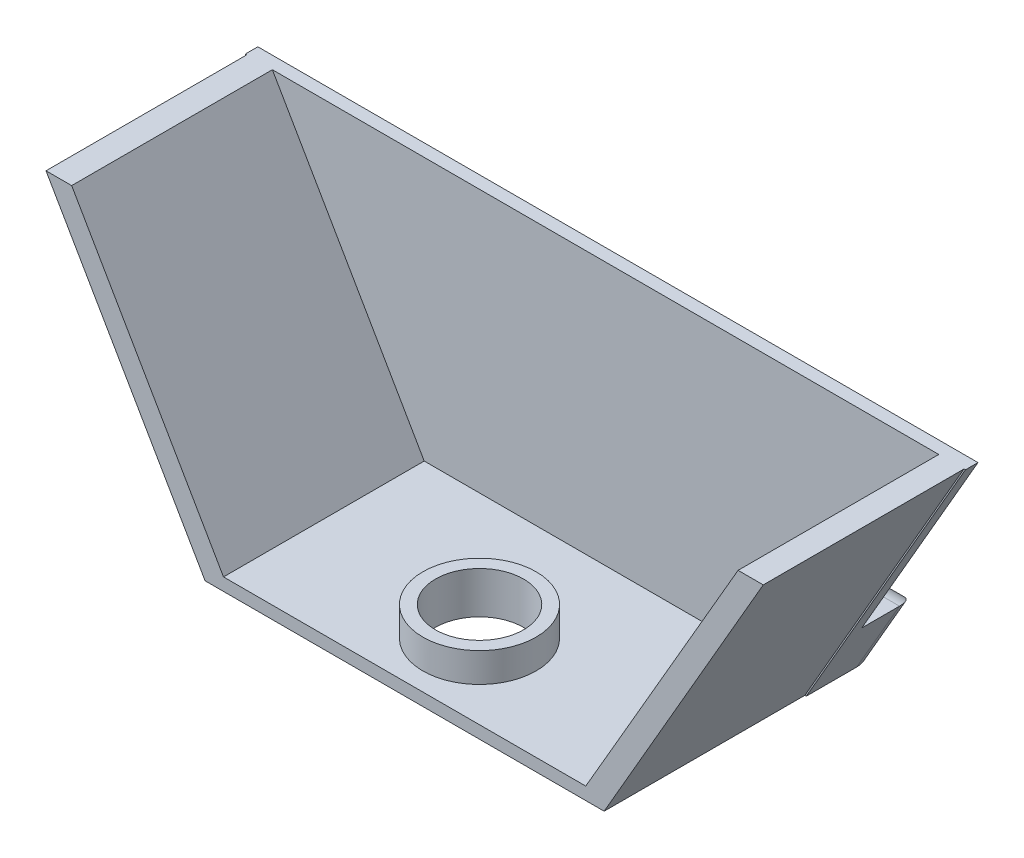
ISO-10303-21;
HEADER;
FILE_DESCRIPTION(('STEP AP214'),'2;1');
FILE_NAME('part.step','',(''),(''),'','','');
FILE_SCHEMA(('AUTOMOTIVE_DESIGN { 1 0 10303 214 1 1 1 1 }'));
ENDSEC;
DATA;
#1=APPLICATION_CONTEXT('core data for automotive mechanical design processes');
#2=APPLICATION_PROTOCOL_DEFINITION('international standard','automotive_design',2000,#1);
#3=PRODUCT_CONTEXT('',#1,'mechanical');
#4=PRODUCT('Part','Part','',(#3));
#5=PRODUCT_RELATED_PRODUCT_CATEGORY('part','',(#4));
#6=PRODUCT_DEFINITION_FORMATION('','',#4);
#7=PRODUCT_DEFINITION_CONTEXT('part definition',#1,'design');
#8=PRODUCT_DEFINITION('design','',#6,#7);
#9=PRODUCT_DEFINITION_SHAPE('','',#8);
#10=(LENGTH_UNIT() NAMED_UNIT(*) SI_UNIT(.MILLI.,.METRE.));
#11=(NAMED_UNIT(*) PLANE_ANGLE_UNIT() SI_UNIT($,.RADIAN.));
#12=(NAMED_UNIT(*) SI_UNIT($,.STERADIAN.) SOLID_ANGLE_UNIT());
#13=UNCERTAINTY_MEASURE_WITH_UNIT(LENGTH_MEASURE(1.E-05),#10,'distance_accuracy_value','');
#14=(GEOMETRIC_REPRESENTATION_CONTEXT(3) GLOBAL_UNCERTAINTY_ASSIGNED_CONTEXT((#13)) GLOBAL_UNIT_ASSIGNED_CONTEXT((#10,
#11,#12)) REPRESENTATION_CONTEXT('',''));
#15=CARTESIAN_POINT('',(0.,0.,0.));
#16=DIRECTION('',(0.,0.,1.));
#17=DIRECTION('',(1.,0.,0.));
#18=AXIS2_PLACEMENT_3D('',#15,#16,#17);
#19=CARTESIAN_POINT('',(0.,0.,1.));
#20=DIRECTION('',(0.,0.,1.));
#21=DIRECTION('',(1.,0.,0.));
#22=AXIS2_PLACEMENT_3D('',#19,#20,#21);
#23=PLANE('',#22);
#24=DIRECTION('',(0.499999999999997,0.86602540378444,0.));
#25=VECTOR('',#24,1.);
#26=CARTESIAN_POINT('',(73.9015839370712,1.50114399294237,1.));
#27=LINE('',#26,#25);
#28=CARTESIAN_POINT('',(73.9015839370712,1.50114399294237,1.));
#29=VERTEX_POINT('',#28);
#30=CARTESIAN_POINT('',(86.5455548323239,23.4011439929424,1.));
#31=VERTEX_POINT('',#30);
#32=EDGE_CURVE('E56',#29,#31,#27,.T.);
#33=ORIENTED_EDGE('',*,*,#32,.F.);
#34=DIRECTION('',(1.,0.,0.));
#35=VECTOR('',#34,1.);
#36=CARTESIAN_POINT('',(42.074789017828,1.50114399294237,1.));
#37=LINE('',#36,#35);
#38=CARTESIAN_POINT('',(74.017053990909,1.50114399294237,1.));
#39=VERTEX_POINT('',#38);
#40=EDGE_CURVE('E248',#29,#39,#37,.T.);
#41=ORIENTED_EDGE('',*,*,#40,.T.);
#42=DIRECTION('',(0.5,0.866025403784439,0.));
#43=VECTOR('',#42,1.);
#44=CARTESIAN_POINT('',(74.017053990909,1.50114399294237,1.));
#45=LINE('',#44,#43);
#46=CARTESIAN_POINT('',(86.6610248861619,23.4011439929424,1.));
#47=VERTEX_POINT('',#46);
#48=EDGE_CURVE('E238',#39,#47,#45,.T.);
#49=ORIENTED_EDGE('',*,*,#48,.T.);
#50=DIRECTION('',(-1.,0.,0.));
#51=VECTOR('',#50,1.);
#52=CARTESIAN_POINT('',(86.6610248861619,23.4011439929424,1.));
#53=LINE('',#52,#51);
#54=EDGE_CURVE('E243',#47,#31,#53,.T.);
#55=ORIENTED_EDGE('',*,*,#54,.T.);
#56=EDGE_LOOP('',(#33,#41,#49,#55));
#57=FACE_BOUND('',#56,.T.);
#58=ADVANCED_FACE('F33',(#57),#23,.T.);
#59=DIRECTION('',(0.500000000000008,-0.866025403784434,0.));
#60=VECTOR('',#59,1.);
#61=CARTESIAN_POINT('',(29.546288176413,23.4011439929424,1.));
#62=LINE('',#61,#60);
#63=CARTESIAN_POINT('',(29.546288176413,23.4011439929424,1.));
#64=VERTEX_POINT('',#63);
#65=CARTESIAN_POINT('',(42.1902590716661,1.50114399294237,1.));
#66=VERTEX_POINT('',#65);
#67=EDGE_CURVE('E387',#64,#66,#62,.T.);
#68=ORIENTED_EDGE('',*,*,#67,.F.);
#69=CARTESIAN_POINT('',(29.4308181225752,23.4011439929424,1.));
#70=VERTEX_POINT('',#69);
#71=EDGE_CURVE('E241',#64,#70,#53,.T.);
#72=ORIENTED_EDGE('',*,*,#71,.T.);
#73=DIRECTION('',(0.5,-0.866025403784439,0.));
#74=VECTOR('',#73,1.);
#75=CARTESIAN_POINT('',(29.4308181225752,23.4011439929424,1.));
#76=LINE('',#75,#74);
#77=CARTESIAN_POINT('',(42.074789017828,1.50114399294237,1.));
#78=VERTEX_POINT('',#77);
#79=EDGE_CURVE('E245',#70,#78,#76,.T.);
#80=ORIENTED_EDGE('',*,*,#79,.T.);
#81=EDGE_CURVE('E249',#78,#66,#37,.T.);
#82=ORIENTED_EDGE('',*,*,#81,.T.);
#83=EDGE_LOOP('',(#68,#72,#80,#82));
#84=FACE_BOUND('',#83,.T.);
#85=ADVANCED_FACE('F384',(#84),#23,.T.);
#86=CARTESIAN_POINT('',(0.,0.,0.));
#87=DIRECTION('',(0.,0.,1.));
#88=DIRECTION('',(1.,0.,0.));
#89=AXIS2_PLACEMENT_3D('',#86,#87,#88);
#90=PLANE('',#89);
#91=DIRECTION('',(1.,0.,0.));
#92=VECTOR('',#91,1.);
#93=CARTESIAN_POINT('',(44.974789017828,7.40114399294237,0.));
#94=LINE('',#93,#92);
#95=CARTESIAN_POINT('',(38.6684224296092,7.40114399294237,0.));
#96=VERTEX_POINT('',#95);
#97=CARTESIAN_POINT('',(44.974789017828,7.40114399294237,0.));
#98=VERTEX_POINT('',#97);
#99=EDGE_CURVE('E212',#96,#98,#94,.T.);
#100=ORIENTED_EDGE('',*,*,#99,.F.);
#101=DIRECTION('',(0.5,-0.866025403784439,0.));
#102=VECTOR('',#101,1.);
#103=CARTESIAN_POINT('',(29.4308181225752,23.4011439929424,0.));
#104=LINE('',#103,#102);
#105=CARTESIAN_POINT('',(29.4308181225752,23.4011439929424,0.));
#106=VERTEX_POINT('',#105);
#107=EDGE_CURVE('E255',#106,#96,#104,.T.);
#108=ORIENTED_EDGE('',*,*,#107,.F.);
#109=DIRECTION('',(-1.,0.,0.));
#110=VECTOR('',#109,1.);
#111=CARTESIAN_POINT('',(86.6610248861619,23.4011439929424,0.));
#112=LINE('',#111,#110);
#113=CARTESIAN_POINT('',(86.6610248861619,23.4011439929424,0.));
#114=VERTEX_POINT('',#113);
#115=EDGE_CURVE('E253',#114,#106,#112,.T.);
#116=ORIENTED_EDGE('',*,*,#115,.F.);
#117=DIRECTION('',(0.5,0.866025403784439,0.));
#118=VECTOR('',#117,1.);
#119=CARTESIAN_POINT('',(74.017053990909,1.50114399294237,0.));
#120=LINE('',#119,#118);
#121=CARTESIAN_POINT('',(77.4234205791278,7.40114399294237,0.));
#122=VERTEX_POINT('',#121);
#123=EDGE_CURVE('E237',#122,#114,#120,.T.);
#124=ORIENTED_EDGE('',*,*,#123,.F.);
#125=DIRECTION('',(1.,0.,0.));
#126=VECTOR('',#125,1.);
#127=CARTESIAN_POINT('',(71.117053990909,7.40114399294237,0.));
#128=LINE('',#127,#126);
#129=CARTESIAN_POINT('',(71.117053990909,7.40114399294237,0.));
#130=VERTEX_POINT('',#129);
#131=EDGE_CURVE('E228',#130,#122,#128,.T.);
#132=ORIENTED_EDGE('',*,*,#131,.F.);
#133=DIRECTION('',(0.,1.,0.));
#134=VECTOR('',#133,1.);
#135=CARTESIAN_POINT('',(71.117053990909,1.50114399294237,0.));
#136=LINE('',#135,#134);
#137=CARTESIAN_POINT('',(71.117053990909,1.50114399294237,0.));
#138=VERTEX_POINT('',#137);
#139=EDGE_CURVE('E225',#138,#130,#136,.T.);
#140=ORIENTED_EDGE('',*,*,#139,.F.);
#141=DIRECTION('',(1.,0.,0.));
#142=VECTOR('',#141,1.);
#143=CARTESIAN_POINT('',(42.074789017828,1.50114399294237,0.));
#144=LINE('',#143,#142);
#145=CARTESIAN_POINT('',(44.974789017828,1.50114399294237,0.));
#146=VERTEX_POINT('',#145);
#147=EDGE_CURVE('E242',#146,#138,#144,.T.);
#148=ORIENTED_EDGE('',*,*,#147,.F.);
#149=DIRECTION('',(0.,-1.,0.));
#150=VECTOR('',#149,1.);
#151=CARTESIAN_POINT('',(44.974789017828,1.50114399294237,0.));
#152=LINE('',#151,#150);
#153=EDGE_CURVE('E215',#98,#146,#152,.T.);
#154=ORIENTED_EDGE('',*,*,#153,.F.);
#155=EDGE_LOOP('',(#100,#108,#116,#124,#132,#140,#148,#154));
#156=FACE_BOUND('',#155,.T.);
#157=ADVANCED_FACE('F345',(#156),#90,.F.);
#158=CARTESIAN_POINT('',(74.017053990909,1.50114399294237,1.));
#159=DIRECTION('',(-0.866025403784439,0.5,0.));
#160=DIRECTION('',(-0.5,-0.866025403784439,0.));
#161=AXIS2_PLACEMENT_3D('',#158,#159,#160);
#162=PLANE('',#161);
#163=DIRECTION('',(0.,0.,-1.));
#164=VECTOR('',#163,1.);
#165=CARTESIAN_POINT('',(74.017053990909,1.50114399294237,1.));
#166=LINE('',#165,#164);
#167=CARTESIAN_POINT('',(74.017053990909,1.50114399294237,-3.));
#168=VERTEX_POINT('',#167);
#169=EDGE_CURVE('E251',#39,#168,#166,.T.);
#170=ORIENTED_EDGE('',*,*,#169,.T.);
#171=DIRECTION('',(-0.5,-0.866025403784439,0.));
#172=VECTOR('',#171,1.);
#173=CARTESIAN_POINT('',(77.4234205791278,7.40114399294238,-3.));
#174=LINE('',#173,#172);
#175=CARTESIAN_POINT('',(77.4234205791278,7.40114399294237,-3.));
#176=VERTEX_POINT('',#175);
#177=EDGE_CURVE('E41',#168,#176,#174,.F.);
#178=ORIENTED_EDGE('',*,*,#177,.T.);
#179=DIRECTION('',(0.,0.,1.));
#180=VECTOR('',#179,1.);
#181=CARTESIAN_POINT('',(77.4234205791278,7.40114399294237,-5.));
#182=LINE('',#181,#180);
#183=EDGE_CURVE('E231',#176,#122,#182,.T.);
#184=ORIENTED_EDGE('',*,*,#183,.T.);
#185=ORIENTED_EDGE('',*,*,#123,.T.);
#186=DIRECTION('',(0.,0.,-1.));
#187=VECTOR('',#186,1.);
#188=CARTESIAN_POINT('',(86.6610248861619,23.4011439929424,1.));
#189=LINE('',#188,#187);
#190=EDGE_CURVE('E268',#47,#114,#189,.T.);
#191=ORIENTED_EDGE('',*,*,#190,.F.);
#192=ORIENTED_EDGE('',*,*,#48,.F.);
#193=EDGE_LOOP('',(#170,#178,#184,#185,#191,#192));
#194=FACE_BOUND('',#193,.T.);
#195=ADVANCED_FACE('F334',(#194),#162,.F.);
#196=CARTESIAN_POINT('',(86.6610248861619,23.4011439929424,1.));
#197=DIRECTION('',(0.,-1.,0.));
#198=DIRECTION('',(0.,0.,-1.));
#199=AXIS2_PLACEMENT_3D('',#196,#197,#198);
#200=PLANE('',#199);
#201=ORIENTED_EDGE('',*,*,#115,.T.);
#202=DIRECTION('',(0.,0.,-1.));
#203=VECTOR('',#202,1.);
#204=CARTESIAN_POINT('',(29.4308181225752,23.4011439929424,1.));
#205=LINE('',#204,#203);
#206=EDGE_CURVE('E265',#70,#106,#205,.T.);
#207=ORIENTED_EDGE('',*,*,#206,.F.);
#208=ORIENTED_EDGE('',*,*,#71,.F.);
#209=DIRECTION('',(0.,0.,-1.));
#210=VECTOR('',#209,1.);
#211=CARTESIAN_POINT('',(29.546288176413,23.4011439929424,16.95));
#212=LINE('',#211,#210);
#213=CARTESIAN_POINT('',(29.546288176413,23.4011439929424,16.95));
#214=VERTEX_POINT('',#213);
#215=EDGE_CURVE('E406',#214,#64,#212,.T.);
#216=ORIENTED_EDGE('',*,*,#215,.F.);
#217=DIRECTION('',(-1.,0.,0.));
#218=VECTOR('',#217,1.);
#219=CARTESIAN_POINT('',(29.546288176413,23.4011439929424,16.95));
#220=LINE('',#219,#218);
#221=CARTESIAN_POINT('',(31.5855186609545,23.4011439929424,16.95));
#222=VERTEX_POINT('',#221);
#223=EDGE_CURVE('E416',#222,#214,#220,.T.);
#224=ORIENTED_EDGE('',*,*,#223,.F.);
#225=DIRECTION('',(0.,0.,-1.));
#226=VECTOR('',#225,1.);
#227=CARTESIAN_POINT('',(31.5855186609545,23.4011439929424,16.95));
#228=LINE('',#227,#226);
#229=CARTESIAN_POINT('',(31.5855186609545,23.4011439929424,1.));
#230=VERTEX_POINT('',#229);
#231=EDGE_CURVE('E208',#222,#230,#228,.T.);
#232=ORIENTED_EDGE('',*,*,#231,.T.);
#233=CARTESIAN_POINT('',(84.5455548323239,23.4011439929424,1.));
#234=VERTEX_POINT('',#233);
#235=EDGE_CURVE('E246',#234,#230,#53,.T.);
#236=ORIENTED_EDGE('',*,*,#235,.F.);
#237=DIRECTION('',(0.,0.,-1.));
#238=VECTOR('',#237,1.);
#239=CARTESIAN_POINT('',(84.5455548323239,23.4011439929424,16.95));
#240=LINE('',#239,#238);
#241=CARTESIAN_POINT('',(84.5455548323239,23.4011439929424,16.95));
#242=VERTEX_POINT('',#241);
#243=EDGE_CURVE('E408',#242,#234,#240,.T.);
#244=ORIENTED_EDGE('',*,*,#243,.F.);
#245=DIRECTION('',(-1.,0.,0.));
#246=VECTOR('',#245,1.);
#247=CARTESIAN_POINT('',(86.5455548323239,23.4011439929424,16.95));
#248=LINE('',#247,#246);
#249=CARTESIAN_POINT('',(86.5455548323239,23.4011439929424,16.95));
#250=VERTEX_POINT('',#249);
#251=EDGE_CURVE('E197',#250,#242,#248,.T.);
#252=ORIENTED_EDGE('',*,*,#251,.F.);
#253=DIRECTION('',(0.,0.,-1.));
#254=VECTOR('',#253,1.);
#255=CARTESIAN_POINT('',(86.5455548323239,23.4011439929424,16.95));
#256=LINE('',#255,#254);
#257=EDGE_CURVE('E404',#250,#31,#256,.T.);
#258=ORIENTED_EDGE('',*,*,#257,.T.);
#259=ORIENTED_EDGE('',*,*,#54,.F.);
#260=ORIENTED_EDGE('',*,*,#190,.T.);
#261=EDGE_LOOP('',(#201,#207,#208,#216,#224,#232,#236,#244,#252,#258,#259,#260));
#262=FACE_BOUND('',#261,.T.);
#263=ADVANCED_FACE('F391',(#262),#200,.F.);
#264=CARTESIAN_POINT('',(29.4308181225752,23.4011439929424,1.));
#265=DIRECTION('',(0.866025403784439,0.5,0.));
#266=DIRECTION('',(-0.5,0.866025403784439,0.));
#267=AXIS2_PLACEMENT_3D('',#264,#265,#266);
#268=PLANE('',#267);
#269=DIRECTION('',(0.,0.,1.));
#270=VECTOR('',#269,1.);
#271=CARTESIAN_POINT('',(38.6684224296092,7.40114399294237,-5.));
#272=LINE('',#271,#270);
#273=CARTESIAN_POINT('',(38.6684224296092,7.40114399294237,-3.));
#274=VERTEX_POINT('',#273);
#275=EDGE_CURVE('E223',#274,#96,#272,.T.);
#276=ORIENTED_EDGE('',*,*,#275,.F.);
#277=DIRECTION('',(-0.5,0.866025403784439,0.));
#278=VECTOR('',#277,1.);
#279=CARTESIAN_POINT('',(29.4308181225752,23.4011439929424,-3.));
#280=LINE('',#279,#278);
#281=CARTESIAN_POINT('',(42.074789017828,1.50114399294237,-3.));
#282=VERTEX_POINT('',#281);
#283=EDGE_CURVE('E291',#274,#282,#280,.F.);
#284=ORIENTED_EDGE('',*,*,#283,.T.);
#285=DIRECTION('',(0.,0.,-1.));
#286=VECTOR('',#285,1.);
#287=CARTESIAN_POINT('',(42.074789017828,1.50114399294237,1.));
#288=LINE('',#287,#286);
#289=EDGE_CURVE('E262',#78,#282,#288,.T.);
#290=ORIENTED_EDGE('',*,*,#289,.F.);
#291=ORIENTED_EDGE('',*,*,#79,.F.);
#292=ORIENTED_EDGE('',*,*,#206,.T.);
#293=ORIENTED_EDGE('',*,*,#107,.T.);
#294=EDGE_LOOP('',(#276,#284,#290,#291,#292,#293));
#295=FACE_BOUND('',#294,.T.);
#296=ADVANCED_FACE('F366',(#295),#268,.F.);
#297=CARTESIAN_POINT('',(42.074789017828,1.50114399294237,1.));
#298=DIRECTION('',(0.,1.,0.));
#299=DIRECTION('',(0.,0.,1.));
#300=AXIS2_PLACEMENT_3D('',#297,#298,#299);
#301=PLANE('',#300);
#302=CARTESIAN_POINT('',(58.0459215043686,1.50114399294237,11.));
#303=DIRECTION('',(0.,1.,0.));
#304=DIRECTION('',(-1.,0.,0.));
#305=AXIS2_PLACEMENT_3D('',#302,#303,#304);
#306=CIRCLE('',#305,3.5);
#307=CARTESIAN_POINT('',(54.5459215043685,1.50114399294237,11.));
#308=VERTEX_POINT('',#307);
#309=EDGE_CURVE('E437',#308,#308,#306,.T.);
#310=ORIENTED_EDGE('',*,*,#309,.T.);
#311=EDGE_LOOP('',(#310));
#312=FACE_BOUND('',#311,.T.);
#313=CARTESIAN_POINT('',(44.3841900945865,1.50114399294237,-3.));
#314=DIRECTION('',(0.,1.,0.));
#315=DIRECTION('',(-1.,0.,0.));
#316=AXIS2_PLACEMENT_3D('',#313,#314,#315);
#317=ELLIPSE('',#316,2.3094010767585,2.);
#318=CARTESIAN_POINT('',(43.6288943339285,1.50114399294237,-4.8900122315607));
#319=VERTEX_POINT('',#318);
#320=EDGE_CURVE('E282',#282,#319,#317,.F.);
#321=ORIENTED_EDGE('',*,*,#320,.T.);
#322=CARTESIAN_POINT('',(42.974789017828,1.50114399294237,-3.));
#323=DIRECTION('',(0.,1.,0.));
#324=DIRECTION('',(0.,0.,1.));
#325=AXIS2_PLACEMENT_3D('',#322,#323,#324);
#326=CIRCLE('',#325,2.);
#327=CARTESIAN_POINT('',(44.974789017828,1.50114399294237,-3.));
#328=VERTEX_POINT('',#327);
#329=EDGE_CURVE('E284',#319,#328,#326,.F.);
#330=ORIENTED_EDGE('',*,*,#329,.T.);
#331=DIRECTION('',(0.,0.,1.));
#332=VECTOR('',#331,1.);
#333=CARTESIAN_POINT('',(44.974789017828,1.50114399294237,-5.));
#334=LINE('',#333,#332);
#335=EDGE_CURVE('E219',#328,#146,#334,.T.);
#336=ORIENTED_EDGE('',*,*,#335,.T.);
#337=ORIENTED_EDGE('',*,*,#147,.T.);
#338=DIRECTION('',(0.,0.,1.));
#339=VECTOR('',#338,1.);
#340=CARTESIAN_POINT('',(71.117053990909,1.50114399294237,-5.));
#341=LINE('',#340,#339);
#342=CARTESIAN_POINT('',(71.117053990909,1.50114399294237,-3.));
#343=VERTEX_POINT('',#342);
#344=EDGE_CURVE('E235',#343,#138,#341,.T.);
#345=ORIENTED_EDGE('',*,*,#344,.F.);
#346=CARTESIAN_POINT('',(73.1170539909091,1.50114399294237,-3.));
#347=DIRECTION('',(0.,1.,0.));
#348=DIRECTION('',(0.,0.,1.));
#349=AXIS2_PLACEMENT_3D('',#346,#347,#348);
#350=CIRCLE('',#349,2.);
#351=CARTESIAN_POINT('',(72.4629486748085,1.50114399294237,-4.8900122315607));
#352=VERTEX_POINT('',#351);
#353=EDGE_CURVE('E280',#343,#352,#350,.F.);
#354=ORIENTED_EDGE('',*,*,#353,.T.);
#355=CARTESIAN_POINT('',(71.7076529141506,1.50114399294237,-3.));
#356=DIRECTION('',(0.,1.,0.));
#357=DIRECTION('',(1.,0.,0.));
#358=AXIS2_PLACEMENT_3D('',#355,#356,#357);
#359=ELLIPSE('',#358,2.3094010767585,2.);
#360=EDGE_CURVE('E278',#352,#168,#359,.F.);
#361=ORIENTED_EDGE('',*,*,#360,.T.);
#362=ORIENTED_EDGE('',*,*,#169,.F.);
#363=ORIENTED_EDGE('',*,*,#40,.F.);
#364=DIRECTION('',(0.,0.,-1.));
#365=VECTOR('',#364,1.);
#366=CARTESIAN_POINT('',(73.9015839370712,1.50114399294237,16.95));
#367=LINE('',#366,#365);
#368=CARTESIAN_POINT('',(73.9015839370712,1.50114399294237,16.95));
#369=VERTEX_POINT('',#368);
#370=EDGE_CURVE('E397',#369,#29,#367,.T.);
#371=ORIENTED_EDGE('',*,*,#370,.F.);
#372=DIRECTION('',(1.,0.,0.));
#373=VECTOR('',#372,1.);
#374=CARTESIAN_POINT('',(42.1902590716661,1.50114399294237,16.95));
#375=LINE('',#374,#373);
#376=CARTESIAN_POINT('',(42.1902590716661,1.50114399294237,16.95));
#377=VERTEX_POINT('',#376);
#378=EDGE_CURVE('E427',#377,#369,#375,.T.);
#379=ORIENTED_EDGE('',*,*,#378,.F.);
#380=DIRECTION('',(0.,0.,-1.));
#381=VECTOR('',#380,1.);
#382=CARTESIAN_POINT('',(42.1902590716661,1.50114399294237,16.95));
#383=LINE('',#382,#381);
#384=EDGE_CURVE('E403',#377,#66,#383,.T.);
#385=ORIENTED_EDGE('',*,*,#384,.T.);
#386=ORIENTED_EDGE('',*,*,#81,.F.);
#387=ORIENTED_EDGE('',*,*,#289,.T.);
#388=EDGE_LOOP('',(#321,#330,#336,#337,#345,#354,#361,#362,#363,#371,#379,#385,#386,#387));
#389=FACE_BOUND('',#388,.T.);
#390=ADVANCED_FACE('F352',(#312,#389),#301,.F.);
#391=DIRECTION('',(-0.501217698069667,-0.865321223096801,0.));
#392=VECTOR('',#391,1.);
#393=CARTESIAN_POINT('',(72.4397037217194,2.50114399294237,1.));
#394=LINE('',#393,#392);
#395=CARTESIAN_POINT('',(72.4397037217194,2.50114399294237,1.));
#396=VERTEX_POINT('',#395);
#397=EDGE_CURVE('E203',#234,#396,#394,.T.);
#398=ORIENTED_EDGE('',*,*,#397,.F.);
#399=ORIENTED_EDGE('',*,*,#235,.T.);
#400=DIRECTION('',(-0.5,0.866025403784438,0.));
#401=VECTOR('',#400,1.);
#402=CARTESIAN_POINT('',(43.6521392870177,2.50114399294237,1.));
#403=LINE('',#402,#401);
#404=CARTESIAN_POINT('',(43.6521392870177,2.50114399294237,1.));
#405=VERTEX_POINT('',#404);
#406=EDGE_CURVE('E420',#405,#230,#403,.T.);
#407=ORIENTED_EDGE('',*,*,#406,.F.);
#408=DIRECTION('',(-1.,0.,0.));
#409=VECTOR('',#408,1.);
#410=CARTESIAN_POINT('',(43.6521392870177,2.50114399294237,1.));
#411=LINE('',#410,#409);
#412=EDGE_CURVE('E48',#396,#405,#411,.T.);
#413=ORIENTED_EDGE('',*,*,#412,.F.);
#414=EDGE_LOOP('',(#398,#399,#407,#413));
#415=FACE_BOUND('',#414,.T.);
#416=ADVANCED_FACE('F458',(#415),#23,.T.);
#417=CARTESIAN_POINT('',(71.117053990909,1.50114399294237,-5.));
#418=DIRECTION('',(1.,0.,0.));
#419=DIRECTION('',(0.,0.,-1.));
#420=AXIS2_PLACEMENT_3D('',#417,#418,#419);
#421=PLANE('',#420);
#422=DIRECTION('',(0.,0.,1.));
#423=VECTOR('',#422,1.);
#424=CARTESIAN_POINT('',(71.117053990909,7.40114399294237,-5.));
#425=LINE('',#424,#423);
#426=CARTESIAN_POINT('',(71.117053990909,7.40114399294237,-3.));
#427=VERTEX_POINT('',#426);
#428=EDGE_CURVE('E233',#427,#130,#425,.T.);
#429=ORIENTED_EDGE('',*,*,#428,.F.);
#430=DIRECTION('',(0.,1.,0.));
#431=VECTOR('',#430,1.);
#432=CARTESIAN_POINT('',(71.117053990909,1.50114399294237,-3.));
#433=LINE('',#432,#431);
#434=EDGE_CURVE('E303',#427,#343,#433,.F.);
#435=ORIENTED_EDGE('',*,*,#434,.T.);
#436=ORIENTED_EDGE('',*,*,#344,.T.);
#437=ORIENTED_EDGE('',*,*,#139,.T.);
#438=EDGE_LOOP('',(#429,#435,#436,#437));
#439=FACE_BOUND('',#438,.T.);
#440=ADVANCED_FACE('F349',(#439),#421,.F.);
#441=CARTESIAN_POINT('',(71.117053990909,7.40114399294237,-5.));
#442=DIRECTION('',(0.,-1.,0.));
#443=DIRECTION('',(1.,0.,0.));
#444=AXIS2_PLACEMENT_3D('',#441,#442,#443);
#445=PLANE('',#444);
#446=ORIENTED_EDGE('',*,*,#183,.F.);
#447=DIRECTION('',(1.,0.,0.));
#448=VECTOR('',#447,1.);
#449=CARTESIAN_POINT('',(71.117053990909,7.40114399294237,-3.));
#450=LINE('',#449,#448);
#451=EDGE_CURVE('E300',#176,#427,#450,.F.);
#452=ORIENTED_EDGE('',*,*,#451,.T.);
#453=ORIENTED_EDGE('',*,*,#428,.T.);
#454=ORIENTED_EDGE('',*,*,#131,.T.);
#455=EDGE_LOOP('',(#446,#452,#453,#454));
#456=FACE_BOUND('',#455,.T.);
#457=ADVANCED_FACE('F339',(#456),#445,.F.);
#458=CARTESIAN_POINT('',(0.,0.,-5.));
#459=DIRECTION('',(0.,0.,-1.));
#460=DIRECTION('',(-1.,0.,0.));
#461=AXIS2_PLACEMENT_3D('',#458,#459,#460);
#462=PLANE('',#461);
#463=DIRECTION('',(0.,1.,0.));
#464=VECTOR('',#463,1.);
#465=CARTESIAN_POINT('',(73.1170539909091,7.40114399294237,-5.));
#466=LINE('',#465,#464);
#467=CARTESIAN_POINT('',(73.1170539909091,3.94229826613035,-5.));
#468=VERTEX_POINT('',#467);
#469=CARTESIAN_POINT('',(73.1170539909091,5.40114399294237,-5.));
#470=VERTEX_POINT('',#469);
#471=EDGE_CURVE('E295',#468,#470,#466,.T.);
#472=ORIENTED_EDGE('',*,*,#471,.T.);
#473=DIRECTION('',(1.,0.,0.));
#474=VECTOR('',#473,1.);
#475=CARTESIAN_POINT('',(77.4234205791278,5.40114399294237,-5.));
#476=LINE('',#475,#474);
#477=CARTESIAN_POINT('',(73.9593189639901,5.40114399294237,-5.));
#478=VERTEX_POINT('',#477);
#479=EDGE_CURVE('E297',#470,#478,#476,.T.);
#480=ORIENTED_EDGE('',*,*,#479,.T.);
#481=DIRECTION('',(-0.5,-0.866025403784439,0.));
#482=VECTOR('',#481,1.);
#483=CARTESIAN_POINT('',(72.2850031833402,2.50114399294237,-5.));
#484=LINE('',#483,#482);
#485=EDGE_CURVE('E293',#478,#468,#484,.T.);
#486=ORIENTED_EDGE('',*,*,#485,.T.);
#487=EDGE_LOOP('',(#472,#480,#486));
#488=FACE_BOUND('',#487,.T.);
#489=ADVANCED_FACE('F328',(#488),#462,.T.);
#490=CARTESIAN_POINT('',(44.974789017828,7.40114399294237,-5.));
#491=DIRECTION('',(0.,-1.,0.));
#492=DIRECTION('',(1.,0.,0.));
#493=AXIS2_PLACEMENT_3D('',#490,#491,#492);
#494=PLANE('',#493);
#495=DIRECTION('',(0.,0.,1.));
#496=VECTOR('',#495,1.);
#497=CARTESIAN_POINT('',(44.974789017828,7.40114399294237,-5.));
#498=LINE('',#497,#496);
#499=CARTESIAN_POINT('',(44.974789017828,7.40114399294237,-3.));
#500=VERTEX_POINT('',#499);
#501=EDGE_CURVE('E221',#500,#98,#498,.T.);
#502=ORIENTED_EDGE('',*,*,#501,.F.);
#503=DIRECTION('',(1.,0.,0.));
#504=VECTOR('',#503,1.);
#505=CARTESIAN_POINT('',(44.974789017828,7.40114399294237,-3.));
#506=LINE('',#505,#504);
#507=EDGE_CURVE('E289',#500,#274,#506,.F.);
#508=ORIENTED_EDGE('',*,*,#507,.T.);
#509=ORIENTED_EDGE('',*,*,#275,.T.);
#510=ORIENTED_EDGE('',*,*,#99,.T.);
#511=EDGE_LOOP('',(#502,#508,#509,#510));
#512=FACE_BOUND('',#511,.T.);
#513=ADVANCED_FACE('F361',(#512),#494,.F.);
#514=CARTESIAN_POINT('',(44.974789017828,1.50114399294237,-5.));
#515=DIRECTION('',(-1.,0.,0.));
#516=DIRECTION('',(0.,0.,1.));
#517=AXIS2_PLACEMENT_3D('',#514,#515,#516);
#518=PLANE('',#517);
#519=ORIENTED_EDGE('',*,*,#335,.F.);
#520=DIRECTION('',(0.,-1.,0.));
#521=VECTOR('',#520,1.);
#522=CARTESIAN_POINT('',(44.974789017828,1.50114399294237,-3.));
#523=LINE('',#522,#521);
#524=EDGE_CURVE('E286',#328,#500,#523,.F.);
#525=ORIENTED_EDGE('',*,*,#524,.T.);
#526=ORIENTED_EDGE('',*,*,#501,.T.);
#527=ORIENTED_EDGE('',*,*,#153,.T.);
#528=EDGE_LOOP('',(#519,#525,#526,#527));
#529=FACE_BOUND('',#528,.T.);
#530=ADVANCED_FACE('F357',(#529),#518,.F.);
#531=CARTESIAN_POINT('',(0.,0.,-5.));
#532=DIRECTION('',(0.,0.,1.));
#533=DIRECTION('',(1.,0.,0.));
#534=AXIS2_PLACEMENT_3D('',#531,#532,#533);
#535=PLANE('',#534);
#536=DIRECTION('',(1.,0.,0.));
#537=VECTOR('',#536,1.);
#538=CARTESIAN_POINT('',(0.,5.40114399294238,-5.));
#539=LINE('',#538,#537);
#540=CARTESIAN_POINT('',(42.132524044747,5.40114399294237,-5.));
#541=VERTEX_POINT('',#540);
#542=CARTESIAN_POINT('',(42.974789017828,5.40114399294237,-5.));
#543=VERTEX_POINT('',#542);
#544=EDGE_CURVE('E273',#541,#543,#539,.T.);
#545=ORIENTED_EDGE('',*,*,#544,.T.);
#546=DIRECTION('',(0.,-1.,0.));
#547=VECTOR('',#546,1.);
#548=CARTESIAN_POINT('',(42.974789017828,0.,-5.));
#549=LINE('',#548,#547);
#550=CARTESIAN_POINT('',(42.974789017828,3.94229826613042,-5.));
#551=VERTEX_POINT('',#550);
#552=EDGE_CURVE('E275',#543,#551,#549,.T.);
#553=ORIENTED_EDGE('',*,*,#552,.T.);
#554=DIRECTION('',(-0.5,0.866025403784439,0.));
#555=VECTOR('',#554,1.);
#556=CARTESIAN_POINT('',(33.9381569872532,19.5942040723904,-5.));
#557=LINE('',#556,#555);
#558=EDGE_CURVE('E271',#551,#541,#557,.T.);
#559=ORIENTED_EDGE('',*,*,#558,.T.);
#560=EDGE_LOOP('',(#545,#553,#559));
#561=FACE_BOUND('',#560,.T.);
#562=ADVANCED_FACE('F489',(#561),#535,.F.);
#563=CARTESIAN_POINT('',(0.,5.40114399294238,-3.));
#564=DIRECTION('',(1.,0.,0.));
#565=DIRECTION('',(0.,1.,0.));
#566=AXIS2_PLACEMENT_3D('',#563,#564,#565);
#567=CYLINDRICAL_SURFACE('',#566,2.);
#568=CARTESIAN_POINT('',(42.974789017828,5.40114399294237,-3.));
#569=DIRECTION('',(0.707106781186547,-0.707106781186548,0.));
#570=DIRECTION('',(0.707106781186548,0.707106781186547,0.));
#571=AXIS2_PLACEMENT_3D('',#568,#569,#570);
#572=ELLIPSE('',#571,2.82842712474619,2.);
#573=EDGE_CURVE('E308',#543,#500,#572,.T.);
#574=ORIENTED_EDGE('',*,*,#573,.F.);
#575=ORIENTED_EDGE('',*,*,#544,.F.);
#576=CARTESIAN_POINT('',(42.132524044747,5.40114399294237,-3.));
#577=DIRECTION('',(0.5,0.866025403784439,0.));
#578=DIRECTION('',(-0.866025403784439,0.5,0.));
#579=AXIS2_PLACEMENT_3D('',#576,#577,#578);
#580=ELLIPSE('',#579,4.,2.);
#581=EDGE_CURVE('E216',#274,#541,#580,.F.);
#582=ORIENTED_EDGE('',*,*,#581,.F.);
#583=ORIENTED_EDGE('',*,*,#507,.F.);
#584=EDGE_LOOP('',(#574,#575,#582,#583));
#585=FACE_BOUND('',#584,.T.);
#586=ADVANCED_FACE('F372',(#585),#567,.T.);
#587=CARTESIAN_POINT('',(33.9381569872532,19.5942040723904,-3.));
#588=DIRECTION('',(-0.5,0.866025403784439,0.));
#589=DIRECTION('',(-0.866025403784439,-0.5,0.));
#590=AXIS2_PLACEMENT_3D('',#587,#588,#589);
#591=CYLINDRICAL_SURFACE('',#590,2.);
#592=ORIENTED_EDGE('',*,*,#581,.T.);
#593=ORIENTED_EDGE('',*,*,#558,.F.);
#594=CARTESIAN_POINT('',(42.974789017828,3.94229826613039,-3.));
#595=DIRECTION('',(-0.965925826289068,-0.258819045102521,0.));
#596=DIRECTION('',(-0.258819045102521,0.965925826289068,0.));
#597=AXIS2_PLACEMENT_3D('',#594,#595,#596);
#598=ELLIPSE('',#597,7.72740661031255,2.);
#599=EDGE_CURVE('E306',#319,#551,#598,.F.);
#600=ORIENTED_EDGE('',*,*,#599,.F.);
#601=ORIENTED_EDGE('',*,*,#320,.F.);
#602=ORIENTED_EDGE('',*,*,#283,.F.);
#603=EDGE_LOOP('',(#592,#593,#600,#601,#602));
#604=FACE_BOUND('',#603,.T.);
#605=ADVANCED_FACE('F376',(#604),#591,.T.);
#606=CARTESIAN_POINT('',(42.974789017828,0.,-3.));
#607=DIRECTION('',(0.,-1.,0.));
#608=DIRECTION('',(0.,0.,-1.));
#609=AXIS2_PLACEMENT_3D('',#606,#607,#608);
#610=CYLINDRICAL_SURFACE('',#609,2.);
#611=ORIENTED_EDGE('',*,*,#573,.T.);
#612=ORIENTED_EDGE('',*,*,#524,.F.);
#613=ORIENTED_EDGE('',*,*,#329,.F.);
#614=ORIENTED_EDGE('',*,*,#599,.T.);
#615=ORIENTED_EDGE('',*,*,#552,.F.);
#616=EDGE_LOOP('',(#611,#612,#613,#614,#615));
#617=FACE_BOUND('',#616,.T.);
#618=ADVANCED_FACE('F481',(#617),#610,.T.);
#619=CARTESIAN_POINT('',(73.1170539909091,0.,-3.));
#620=DIRECTION('',(0.,-1.,0.));
#621=DIRECTION('',(0.,0.,-1.));
#622=AXIS2_PLACEMENT_3D('',#619,#620,#621);
#623=CYLINDRICAL_SURFACE('',#622,2.);
#624=CARTESIAN_POINT('',(73.1170539909091,5.40114399294237,-3.));
#625=DIRECTION('',(-0.707106781186547,-0.707106781186548,0.));
#626=DIRECTION('',(0.707106781186548,-0.707106781186547,0.));
#627=AXIS2_PLACEMENT_3D('',#624,#625,#626);
#628=ELLIPSE('',#627,2.82842712474619,2.);
#629=EDGE_CURVE('E206',#470,#427,#628,.F.);
#630=ORIENTED_EDGE('',*,*,#629,.F.);
#631=ORIENTED_EDGE('',*,*,#471,.F.);
#632=CARTESIAN_POINT('',(73.1170539909091,3.94229826613034,-3.));
#633=DIRECTION('',(0.965925826289068,-0.258819045102521,0.));
#634=DIRECTION('',(0.258819045102521,0.965925826289068,0.));
#635=AXIS2_PLACEMENT_3D('',#632,#633,#634);
#636=ELLIPSE('',#635,7.72740661031255,2.);
#637=EDGE_CURVE('E309',#352,#468,#636,.T.);
#638=ORIENTED_EDGE('',*,*,#637,.F.);
#639=ORIENTED_EDGE('',*,*,#353,.F.);
#640=ORIENTED_EDGE('',*,*,#434,.F.);
#641=EDGE_LOOP('',(#630,#631,#638,#639,#640));
#642=FACE_BOUND('',#641,.T.);
#643=ADVANCED_FACE('F35',(#642),#623,.T.);
#644=CARTESIAN_POINT('',(53.1307252692997,-30.6750385364702,-3.));
#645=DIRECTION('',(0.5,0.866025403784439,0.));
#646=DIRECTION('',(-0.866025403784439,0.5,0.));
#647=AXIS2_PLACEMENT_3D('',#644,#645,#646);
#648=CYLINDRICAL_SURFACE('',#647,2.);
#649=ORIENTED_EDGE('',*,*,#637,.T.);
#650=ORIENTED_EDGE('',*,*,#485,.F.);
#651=CARTESIAN_POINT('',(73.9593189639901,5.40114399294237,-3.));
#652=DIRECTION('',(-0.5,0.866025403784439,0.));
#653=DIRECTION('',(0.866025403784439,0.5,0.));
#654=AXIS2_PLACEMENT_3D('',#651,#652,#653);
#655=ELLIPSE('',#654,4.,2.);
#656=EDGE_CURVE('E204',#176,#478,#655,.T.);
#657=ORIENTED_EDGE('',*,*,#656,.F.);
#658=ORIENTED_EDGE('',*,*,#177,.F.);
#659=ORIENTED_EDGE('',*,*,#360,.F.);
#660=EDGE_LOOP('',(#649,#650,#657,#658,#659));
#661=FACE_BOUND('',#660,.T.);
#662=ADVANCED_FACE('F318',(#661),#648,.T.);
#663=CARTESIAN_POINT('',(0.,5.40114399294235,-3.));
#664=DIRECTION('',(-1.,0.,0.));
#665=DIRECTION('',(0.,-1.,0.));
#666=AXIS2_PLACEMENT_3D('',#663,#664,#665);
#667=CYLINDRICAL_SURFACE('',#666,2.);
#668=ORIENTED_EDGE('',*,*,#629,.T.);
#669=ORIENTED_EDGE('',*,*,#451,.F.);
#670=ORIENTED_EDGE('',*,*,#656,.T.);
#671=ORIENTED_EDGE('',*,*,#479,.F.);
#672=EDGE_LOOP('',(#668,#669,#670,#671));
#673=FACE_BOUND('',#672,.T.);
#674=ADVANCED_FACE('F330',(#673),#667,.T.);
#675=CARTESIAN_POINT('',(72.4397037217194,2.50114399294237,16.95));
#676=DIRECTION('',(0.865321223096801,-0.501217698069667,0.));
#677=DIRECTION('',(0.501217698069667,0.865321223096801,0.));
#678=AXIS2_PLACEMENT_3D('',#675,#676,#677);
#679=PLANE('',#678);
#680=ORIENTED_EDGE('',*,*,#397,.T.);
#681=DIRECTION('',(0.,0.,-1.));
#682=VECTOR('',#681,1.);
#683=CARTESIAN_POINT('',(72.4397037217194,2.50114399294237,16.95));
#684=LINE('',#683,#682);
#685=CARTESIAN_POINT('',(72.4397037217194,2.50114399294237,16.95));
#686=VERTEX_POINT('',#685);
#687=EDGE_CURVE('E185',#686,#396,#684,.T.);
#688=ORIENTED_EDGE('',*,*,#687,.F.);
#689=DIRECTION('',(-0.501217698069667,-0.865321223096801,0.));
#690=VECTOR('',#689,1.);
#691=CARTESIAN_POINT('',(72.4397037217194,2.50114399294237,16.95));
#692=LINE('',#691,#690);
#693=EDGE_CURVE('E192',#242,#686,#692,.T.);
#694=ORIENTED_EDGE('',*,*,#693,.F.);
#695=ORIENTED_EDGE('',*,*,#243,.T.);
#696=EDGE_LOOP('',(#680,#688,#694,#695));
#697=FACE_BOUND('',#696,.T.);
#698=ADVANCED_FACE('F202',(#697),#679,.F.);
#699=CARTESIAN_POINT('',(43.6521392870177,2.50114399294237,16.95));
#700=DIRECTION('',(0.,-1.,0.));
#701=DIRECTION('',(1.,0.,0.));
#702=AXIS2_PLACEMENT_3D('',#699,#700,#701);
#703=PLANE('',#702);
#704=CARTESIAN_POINT('',(58.0459215043686,2.50114399294237,11.));
#705=DIRECTION('',(0.,-1.,0.));
#706=DIRECTION('',(1.,0.,0.));
#707=AXIS2_PLACEMENT_3D('',#704,#705,#706);
#708=CIRCLE('',#707,4.5);
#709=CARTESIAN_POINT('',(62.5459215043686,2.50114399294237,11.));
#710=VERTEX_POINT('',#709);
#711=EDGE_CURVE('E11',#710,#710,#708,.F.);
#712=ORIENTED_EDGE('',*,*,#711,.F.);
#713=EDGE_LOOP('',(#712));
#714=FACE_BOUND('',#713,.T.);
#715=ORIENTED_EDGE('',*,*,#412,.T.);
#716=DIRECTION('',(0.,0.,-1.));
#717=VECTOR('',#716,1.);
#718=CARTESIAN_POINT('',(43.6521392870177,2.50114399294237,16.95));
#719=LINE('',#718,#717);
#720=CARTESIAN_POINT('',(43.6521392870177,2.50114399294237,16.95));
#721=VERTEX_POINT('',#720);
#722=EDGE_CURVE('E188',#721,#405,#719,.T.);
#723=ORIENTED_EDGE('',*,*,#722,.F.);
#724=DIRECTION('',(-1.,0.,0.));
#725=VECTOR('',#724,1.);
#726=CARTESIAN_POINT('',(43.6521392870177,2.50114399294237,16.95));
#727=LINE('',#726,#725);
#728=EDGE_CURVE('E181',#686,#721,#727,.T.);
#729=ORIENTED_EDGE('',*,*,#728,.F.);
#730=ORIENTED_EDGE('',*,*,#687,.T.);
#731=EDGE_LOOP('',(#715,#723,#729,#730));
#732=FACE_BOUND('',#731,.T.);
#733=ADVANCED_FACE('F183',(#714,#732),#703,.F.);
#734=CARTESIAN_POINT('',(43.6521392870177,2.50114399294237,16.95));
#735=DIRECTION('',(-0.866025403784439,-0.5,0.));
#736=DIRECTION('',(0.5,-0.866025403784439,0.));
#737=AXIS2_PLACEMENT_3D('',#734,#735,#736);
#738=PLANE('',#737);
#739=ORIENTED_EDGE('',*,*,#406,.T.);
#740=ORIENTED_EDGE('',*,*,#231,.F.);
#741=DIRECTION('',(-0.5,0.866025403784438,0.));
#742=VECTOR('',#741,1.);
#743=CARTESIAN_POINT('',(43.6521392870177,2.50114399294237,16.95));
#744=LINE('',#743,#742);
#745=EDGE_CURVE('E191',#721,#222,#744,.T.);
#746=ORIENTED_EDGE('',*,*,#745,.F.);
#747=ORIENTED_EDGE('',*,*,#722,.T.);
#748=EDGE_LOOP('',(#739,#740,#746,#747));
#749=FACE_BOUND('',#748,.T.);
#750=ADVANCED_FACE('F419',(#749),#738,.F.);
#751=CARTESIAN_POINT('',(29.546288176413,23.4011439929424,16.95));
#752=DIRECTION('',(0.866025403784434,0.500000000000008,0.));
#753=DIRECTION('',(-0.500000000000008,0.866025403784434,0.));
#754=AXIS2_PLACEMENT_3D('',#751,#752,#753);
#755=PLANE('',#754);
#756=ORIENTED_EDGE('',*,*,#67,.T.);
#757=ORIENTED_EDGE('',*,*,#384,.F.);
#758=DIRECTION('',(0.500000000000008,-0.866025403784434,0.));
#759=VECTOR('',#758,1.);
#760=CARTESIAN_POINT('',(29.546288176413,23.4011439929424,16.95));
#761=LINE('',#760,#759);
#762=EDGE_CURVE('E443',#214,#377,#761,.T.);
#763=ORIENTED_EDGE('',*,*,#762,.F.);
#764=ORIENTED_EDGE('',*,*,#215,.T.);
#765=EDGE_LOOP('',(#756,#757,#763,#764));
#766=FACE_BOUND('',#765,.T.);
#767=ADVANCED_FACE('F447',(#766),#755,.F.);
#768=CARTESIAN_POINT('',(73.9015839370712,1.50114399294237,16.95));
#769=DIRECTION('',(-0.86602540378444,0.499999999999997,0.));
#770=DIRECTION('',(-0.499999999999997,-0.86602540378444,0.));
#771=AXIS2_PLACEMENT_3D('',#768,#769,#770);
#772=PLANE('',#771);
#773=ORIENTED_EDGE('',*,*,#32,.T.);
#774=ORIENTED_EDGE('',*,*,#257,.F.);
#775=DIRECTION('',(0.499999999999997,0.86602540378444,0.));
#776=VECTOR('',#775,1.);
#777=CARTESIAN_POINT('',(73.9015839370712,1.50114399294237,16.95));
#778=LINE('',#777,#776);
#779=EDGE_CURVE('E402',#369,#250,#778,.T.);
#780=ORIENTED_EDGE('',*,*,#779,.F.);
#781=ORIENTED_EDGE('',*,*,#370,.T.);
#782=EDGE_LOOP('',(#773,#774,#780,#781));
#783=FACE_BOUND('',#782,.T.);
#784=ADVANCED_FACE('F400',(#783),#772,.F.);
#785=CARTESIAN_POINT('',(0.,0.,16.95));
#786=DIRECTION('',(0.,0.,-1.));
#787=DIRECTION('',(-1.,0.,0.));
#788=AXIS2_PLACEMENT_3D('',#785,#786,#787);
#789=PLANE('',#788);
#790=ORIENTED_EDGE('',*,*,#693,.T.);
#791=ORIENTED_EDGE('',*,*,#728,.T.);
#792=ORIENTED_EDGE('',*,*,#745,.T.);
#793=ORIENTED_EDGE('',*,*,#223,.T.);
#794=ORIENTED_EDGE('',*,*,#762,.T.);
#795=ORIENTED_EDGE('',*,*,#378,.T.);
#796=ORIENTED_EDGE('',*,*,#779,.T.);
#797=ORIENTED_EDGE('',*,*,#251,.T.);
#798=EDGE_LOOP('',(#790,#791,#792,#793,#794,#795,#796,#797));
#799=FACE_BOUND('',#798,.T.);
#800=ADVANCED_FACE('F195',(#799),#789,.F.);
#801=CARTESIAN_POINT('',(58.0459215043686,4.83114399294237,11.));
#802=DIRECTION('',(0.,1.,0.));
#803=DIRECTION('',(-1.,0.,0.));
#804=AXIS2_PLACEMENT_3D('',#801,#802,#803);
#805=PLANE('',#804);
#806=CARTESIAN_POINT('',(58.0459215043686,4.83114399294237,11.));
#807=DIRECTION('',(0.,1.,0.));
#808=DIRECTION('',(-1.,0.,0.));
#809=AXIS2_PLACEMENT_3D('',#806,#807,#808);
#810=CIRCLE('',#809,4.5);
#811=CARTESIAN_POINT('',(53.5459215043685,4.83114399294237,11.));
#812=VERTEX_POINT('',#811);
#813=EDGE_CURVE('E430',#812,#812,#810,.T.);
#814=ORIENTED_EDGE('',*,*,#813,.T.);
#815=EDGE_LOOP('',(#814));
#816=FACE_BOUND('',#815,.T.);
#817=CARTESIAN_POINT('',(58.0459215043686,4.83114399294237,11.));
#818=DIRECTION('',(0.,1.,0.));
#819=DIRECTION('',(-1.,0.,0.));
#820=AXIS2_PLACEMENT_3D('',#817,#818,#819);
#821=CIRCLE('',#820,3.5);
#822=CARTESIAN_POINT('',(54.5459215043685,4.83114399294237,11.));
#823=VERTEX_POINT('',#822);
#824=EDGE_CURVE('E432',#823,#823,#821,.T.);
#825=ORIENTED_EDGE('',*,*,#824,.F.);
#826=EDGE_LOOP('',(#825));
#827=FACE_BOUND('',#826,.T.);
#828=ADVANCED_FACE('F625',(#816,#827),#805,.T.);
#829=CARTESIAN_POINT('',(58.0459215043686,4.83114399294237,11.));
#830=DIRECTION('',(0.,-1.,0.));
#831=DIRECTION('',(1.,0.,0.));
#832=AXIS2_PLACEMENT_3D('',#829,#830,#831);
#833=CYLINDRICAL_SURFACE('',#832,4.5);
#834=ORIENTED_EDGE('',*,*,#813,.F.);
#835=EDGE_LOOP('',(#834));
#836=FACE_BOUND('',#835,.T.);
#837=ORIENTED_EDGE('',*,*,#711,.T.);
#838=EDGE_LOOP('',(#837));
#839=FACE_BOUND('',#838,.T.);
#840=ADVANCED_FACE('F641',(#836,#839),#833,.T.);
#841=CARTESIAN_POINT('',(58.0459215043686,4.83114399294237,11.));
#842=DIRECTION('',(0.,-1.,0.));
#843=DIRECTION('',(1.,0.,0.));
#844=AXIS2_PLACEMENT_3D('',#841,#842,#843);
#845=CYLINDRICAL_SURFACE('',#844,3.5);
#846=ORIENTED_EDGE('',*,*,#824,.T.);
#847=EDGE_LOOP('',(#846));
#848=FACE_BOUND('',#847,.T.);
#849=ORIENTED_EDGE('',*,*,#309,.F.);
#850=EDGE_LOOP('',(#849));
#851=FACE_BOUND('',#850,.T.);
#852=ADVANCED_FACE('F649',(#848,#851),#845,.F.);
#853=CLOSED_SHELL('',(#58,#85,#157,#195,#263,#296,#390,#416,#440,#457,#489,#513,#530,#562,#586,
#605,#618,#643,#662,#674,#698,#733,#750,#767,#784,#800,#828,#840,#852));
#854=MANIFOLD_SOLID_BREP('B2',#853);
#855=ADVANCED_BREP_SHAPE_REPRESENTATION('',(#18,#854),#14);
#856=SHAPE_DEFINITION_REPRESENTATION(#9,#855);
ENDSEC;
END-ISO-10303-21;
